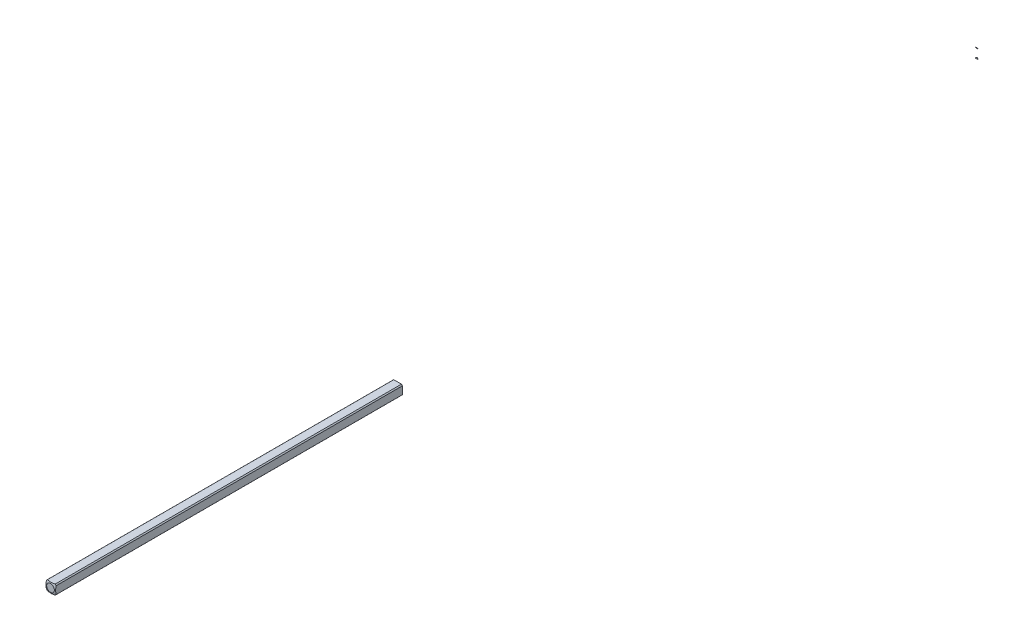
ISO-10303-21;
HEADER;
FILE_DESCRIPTION(('STEP AP214'),'2;1');
FILE_NAME('part.step','',(''),(''),'','','');
FILE_SCHEMA(('AUTOMOTIVE_DESIGN { 1 0 10303 214 1 1 1 1 }'));
ENDSEC;
DATA;
#1=APPLICATION_CONTEXT('core data for automotive mechanical design processes');
#2=APPLICATION_PROTOCOL_DEFINITION('international standard','automotive_design',2000,#1);
#3=PRODUCT_CONTEXT('',#1,'mechanical');
#4=PRODUCT('Part','Part','',(#3));
#5=PRODUCT_RELATED_PRODUCT_CATEGORY('part','',(#4));
#6=PRODUCT_DEFINITION_FORMATION('','',#4);
#7=PRODUCT_DEFINITION_CONTEXT('part definition',#1,'design');
#8=PRODUCT_DEFINITION('design','',#6,#7);
#9=PRODUCT_DEFINITION_SHAPE('','',#8);
#10=(LENGTH_UNIT() NAMED_UNIT(*) SI_UNIT(.MILLI.,.METRE.));
#11=(NAMED_UNIT(*) PLANE_ANGLE_UNIT() SI_UNIT($,.RADIAN.));
#12=(NAMED_UNIT(*) SI_UNIT($,.STERADIAN.) SOLID_ANGLE_UNIT());
#13=UNCERTAINTY_MEASURE_WITH_UNIT(LENGTH_MEASURE(1.E-05),#10,'distance_accuracy_value','');
#14=(GEOMETRIC_REPRESENTATION_CONTEXT(3) GLOBAL_UNCERTAINTY_ASSIGNED_CONTEXT((#13)) GLOBAL_UNIT_ASSIGNED_CONTEXT((#10,
#11,#12)) REPRESENTATION_CONTEXT('',''));
#15=CARTESIAN_POINT('',(0.,0.,0.));
#16=DIRECTION('',(0.,0.,1.));
#17=DIRECTION('',(1.,0.,0.));
#18=AXIS2_PLACEMENT_3D('',#15,#16,#17);
#19=CARTESIAN_POINT('',(-1.5875,-1.5875,152.4));
#20=DIRECTION('',(0.,1.,0.));
#21=DIRECTION('',(0.,0.,1.));
#22=AXIS2_PLACEMENT_3D('',#19,#20,#21);
#23=PLANE('',#22);
#24=DIRECTION('',(0.,0.,-1.));
#25=VECTOR('',#24,1.);
#26=CARTESIAN_POINT('',(-1.26841150657032,-1.5875,152.4));
#27=LINE('',#26,#25);
#28=CARTESIAN_POINT('',(-1.26841150657032,-1.5875,190.615912538673));
#29=VERTEX_POINT('',#28);
#30=CARTESIAN_POINT('',(-1.26841150657032,-1.5875,304.536774642313));
#31=VERTEX_POINT('',#30);
#32=EDGE_CURVE('E114',#29,#31,#27,.F.);
#33=ORIENTED_EDGE('',*,*,#32,.F.);
#34=DIRECTION('',(1.,0.,0.));
#35=VECTOR('',#34,1.);
#36=CARTESIAN_POINT('',(-1.5875,-1.5875,190.615912538673));
#37=LINE('',#36,#35);
#38=CARTESIAN_POINT('',(1.26841150657032,-1.5875,190.615912538673));
#39=VERTEX_POINT('',#38);
#40=EDGE_CURVE('E61',#29,#39,#37,.T.);
#41=ORIENTED_EDGE('',*,*,#40,.T.);
#42=DIRECTION('',(0.,0.,-1.));
#43=VECTOR('',#42,1.);
#44=CARTESIAN_POINT('',(1.26841150657032,-1.5875,152.4));
#45=LINE('',#44,#43);
#46=CARTESIAN_POINT('',(1.26841150657032,-1.5875,304.536774642313));
#47=VERTEX_POINT('',#46);
#48=EDGE_CURVE('E110',#47,#39,#45,.T.);
#49=ORIENTED_EDGE('',*,*,#48,.F.);
#50=CARTESIAN_POINT('',(0.,-1.5875,299.880877736238));
#51=DIRECTION('',(0.,-1.,0.));
#52=DIRECTION('',(0.,0.,-1.));
#53=AXIS2_PLACEMENT_3D('',#50,#51,#52);
#54=CIRCLE('',#53,4.82558221875869);
#55=EDGE_CURVE('E130',#47,#31,#54,.T.);
#56=ORIENTED_EDGE('',*,*,#55,.T.);
#57=EDGE_LOOP('',(#33,#41,#49,#56));
#58=FACE_BOUND('',#57,.T.);
#59=ADVANCED_FACE('F44',(#58),#23,.F.);
#60=CARTESIAN_POINT('',(-1.5875,1.5875,152.4));
#61=DIRECTION('',(0.,-1.,0.));
#62=DIRECTION('',(0.,0.,-1.));
#63=AXIS2_PLACEMENT_3D('',#60,#61,#62);
#64=PLANE('',#63);
#65=DIRECTION('',(0.,0.,-1.));
#66=VECTOR('',#65,1.);
#67=CARTESIAN_POINT('',(1.26841150657032,1.5875,152.4));
#68=LINE('',#67,#66);
#69=CARTESIAN_POINT('',(1.26841150657032,1.5875,190.615912538673));
#70=VERTEX_POINT('',#69);
#71=CARTESIAN_POINT('',(1.26841150657032,1.5875,304.536774642313));
#72=VERTEX_POINT('',#71);
#73=EDGE_CURVE('E105',#70,#72,#68,.F.);
#74=ORIENTED_EDGE('',*,*,#73,.F.);
#75=DIRECTION('',(1.,0.,0.));
#76=VECTOR('',#75,1.);
#77=CARTESIAN_POINT('',(-1.5875,1.5875,190.615912538673));
#78=LINE('',#77,#76);
#79=CARTESIAN_POINT('',(-1.26841150657032,1.5875,190.615912538673));
#80=VERTEX_POINT('',#79);
#81=EDGE_CURVE('E84',#80,#70,#78,.T.);
#82=ORIENTED_EDGE('',*,*,#81,.F.);
#83=DIRECTION('',(0.,0.,-1.));
#84=VECTOR('',#83,1.);
#85=CARTESIAN_POINT('',(-1.26841150657032,1.5875,152.4));
#86=LINE('',#85,#84);
#87=CARTESIAN_POINT('',(-1.26841150657032,1.5875,304.536774642313));
#88=VERTEX_POINT('',#87);
#89=EDGE_CURVE('E108',#88,#80,#86,.T.);
#90=ORIENTED_EDGE('',*,*,#89,.F.);
#91=CARTESIAN_POINT('',(0.,1.5875,299.880877736238));
#92=DIRECTION('',(0.,1.,0.));
#93=DIRECTION('',(0.,0.,1.));
#94=AXIS2_PLACEMENT_3D('',#91,#92,#93);
#95=CIRCLE('',#94,4.82558221875869);
#96=EDGE_CURVE('E133',#88,#72,#95,.T.);
#97=ORIENTED_EDGE('',*,*,#96,.T.);
#98=EDGE_LOOP('',(#74,#82,#90,#97));
#99=FACE_BOUND('',#98,.T.);
#100=ADVANCED_FACE('F168',(#99),#64,.F.);
#101=CARTESIAN_POINT('',(-1.5875,-1.5875,152.4));
#102=DIRECTION('',(1.,0.,0.));
#103=DIRECTION('',(0.,0.,-1.));
#104=AXIS2_PLACEMENT_3D('',#101,#102,#103);
#105=PLANE('',#104);
#106=DIRECTION('',(0.,0.,-1.));
#107=VECTOR('',#106,1.);
#108=CARTESIAN_POINT('',(-1.5875,1.26841150657032,152.4));
#109=LINE('',#108,#107);
#110=CARTESIAN_POINT('',(-1.5875,1.26841150657032,190.615912538673));
#111=VERTEX_POINT('',#110);
#112=CARTESIAN_POINT('',(-1.5875,1.26841150657032,304.536774642313));
#113=VERTEX_POINT('',#112);
#114=EDGE_CURVE('E104',#111,#113,#109,.F.);
#115=ORIENTED_EDGE('',*,*,#114,.F.);
#116=DIRECTION('',(0.,-1.,0.));
#117=VECTOR('',#116,1.);
#118=CARTESIAN_POINT('',(-1.5875,1.5875,190.615912538673));
#119=LINE('',#118,#117);
#120=CARTESIAN_POINT('',(-1.5875,-1.26841150657032,190.615912538673));
#121=VERTEX_POINT('',#120);
#122=EDGE_CURVE('E47',#111,#121,#119,.T.);
#123=ORIENTED_EDGE('',*,*,#122,.T.);
#124=DIRECTION('',(0.,0.,-1.));
#125=VECTOR('',#124,1.);
#126=CARTESIAN_POINT('',(-1.5875,-1.26841150657032,152.4));
#127=LINE('',#126,#125);
#128=CARTESIAN_POINT('',(-1.5875,-1.26841150657032,304.536774642313));
#129=VERTEX_POINT('',#128);
#130=EDGE_CURVE('E117',#129,#121,#127,.T.);
#131=ORIENTED_EDGE('',*,*,#130,.F.);
#132=CARTESIAN_POINT('',(-1.5875,0.,299.880877736238));
#133=DIRECTION('',(-1.,0.,0.));
#134=DIRECTION('',(0.,0.,1.));
#135=AXIS2_PLACEMENT_3D('',#132,#133,#134);
#136=CIRCLE('',#135,4.82558221875869);
#137=EDGE_CURVE('E136',#129,#113,#136,.T.);
#138=ORIENTED_EDGE('',*,*,#137,.T.);
#139=EDGE_LOOP('',(#115,#123,#131,#138));
#140=FACE_BOUND('',#139,.T.);
#141=ADVANCED_FACE('F193',(#140),#105,.F.);
#142=CARTESIAN_POINT('',(1.5875,-1.5875,152.4));
#143=DIRECTION('',(-1.,0.,0.));
#144=DIRECTION('',(0.,0.,1.));
#145=AXIS2_PLACEMENT_3D('',#142,#143,#144);
#146=PLANE('',#145);
#147=DIRECTION('',(0.,0.,-1.));
#148=VECTOR('',#147,1.);
#149=CARTESIAN_POINT('',(1.5875,-1.26841150657032,152.4));
#150=LINE('',#149,#148);
#151=CARTESIAN_POINT('',(1.5875,-1.26841150657032,190.615912538673));
#152=VERTEX_POINT('',#151);
#153=CARTESIAN_POINT('',(1.5875,-1.26841150657032,304.536774642313));
#154=VERTEX_POINT('',#153);
#155=EDGE_CURVE('E99',#152,#154,#150,.F.);
#156=ORIENTED_EDGE('',*,*,#155,.F.);
#157=DIRECTION('',(0.,-1.,0.));
#158=VECTOR('',#157,1.);
#159=CARTESIAN_POINT('',(1.5875,1.5875,190.615912538673));
#160=LINE('',#159,#158);
#161=CARTESIAN_POINT('',(1.5875,1.26841150657032,190.615912538673));
#162=VERTEX_POINT('',#161);
#163=EDGE_CURVE('E53',#162,#152,#160,.T.);
#164=ORIENTED_EDGE('',*,*,#163,.F.);
#165=DIRECTION('',(0.,0.,-1.));
#166=VECTOR('',#165,1.);
#167=CARTESIAN_POINT('',(1.5875,1.26841150657032,152.4));
#168=LINE('',#167,#166);
#169=CARTESIAN_POINT('',(1.5875,1.26841150657032,304.536774642313));
#170=VERTEX_POINT('',#169);
#171=EDGE_CURVE('E96',#170,#162,#168,.T.);
#172=ORIENTED_EDGE('',*,*,#171,.F.);
#173=CARTESIAN_POINT('',(1.5875,0.,299.880877736238));
#174=DIRECTION('',(1.,0.,0.));
#175=DIRECTION('',(0.,0.,-1.));
#176=AXIS2_PLACEMENT_3D('',#173,#174,#175);
#177=CIRCLE('',#176,4.82558221875869);
#178=EDGE_CURVE('E134',#170,#154,#177,.T.);
#179=ORIENTED_EDGE('',*,*,#178,.T.);
#180=EDGE_LOOP('',(#156,#164,#172,#179));
#181=FACE_BOUND('',#180,.T.);
#182=ADVANCED_FACE('F93',(#181),#146,.F.);
#183=CARTESIAN_POINT('',(0.,0.,152.4));
#184=DIRECTION('',(0.,0.,-1.));
#185=DIRECTION('',(-1.,0.,0.));
#186=AXIS2_PLACEMENT_3D('',#183,#184,#185);
#187=CYLINDRICAL_SURFACE('',#186,2.032);
#188=CARTESIAN_POINT('',(0.,0.,190.615912538673));
#189=DIRECTION('',(0.,0.,1.));
#190=DIRECTION('',(1.,0.,0.));
#191=AXIS2_PLACEMENT_3D('',#188,#189,#190);
#192=CIRCLE('',#191,2.032);
#193=EDGE_CURVE('E139',#29,#121,#192,.F.);
#194=ORIENTED_EDGE('',*,*,#193,.F.);
#195=ORIENTED_EDGE('',*,*,#32,.T.);
#196=CARTESIAN_POINT('',(0.,0.,304.536774642313));
#197=DIRECTION('',(0.,0.,1.));
#198=DIRECTION('',(1.,0.,0.));
#199=AXIS2_PLACEMENT_3D('',#196,#197,#198);
#200=CIRCLE('',#199,2.032);
#201=EDGE_CURVE('E124',#129,#31,#200,.T.);
#202=ORIENTED_EDGE('',*,*,#201,.F.);
#203=ORIENTED_EDGE('',*,*,#130,.T.);
#204=EDGE_LOOP('',(#194,#195,#202,#203));
#205=FACE_BOUND('',#204,.T.);
#206=ADVANCED_FACE('F191',(#205),#187,.T.);
#207=CARTESIAN_POINT('',(0.,0.,190.615912538673));
#208=DIRECTION('',(0.,0.,1.));
#209=DIRECTION('',(1.,0.,0.));
#210=AXIS2_PLACEMENT_3D('',#207,#208,#209);
#211=CIRCLE('',#210,2.032);
#212=EDGE_CURVE('E13',#152,#39,#211,.F.);
#213=ORIENTED_EDGE('',*,*,#212,.F.);
#214=ORIENTED_EDGE('',*,*,#155,.T.);
#215=CARTESIAN_POINT('',(0.,0.,304.536774642313));
#216=DIRECTION('',(0.,0.,1.));
#217=DIRECTION('',(1.,0.,0.));
#218=AXIS2_PLACEMENT_3D('',#215,#216,#217);
#219=CIRCLE('',#218,2.032);
#220=EDGE_CURVE('E127',#47,#154,#219,.T.);
#221=ORIENTED_EDGE('',*,*,#220,.F.);
#222=ORIENTED_EDGE('',*,*,#48,.T.);
#223=EDGE_LOOP('',(#213,#214,#221,#222));
#224=FACE_BOUND('',#223,.T.);
#225=ADVANCED_FACE('F156',(#224),#187,.T.);
#226=CARTESIAN_POINT('',(0.,0.,190.615912538673));
#227=DIRECTION('',(0.,0.,1.));
#228=DIRECTION('',(1.,0.,0.));
#229=AXIS2_PLACEMENT_3D('',#226,#227,#228);
#230=CIRCLE('',#229,2.032);
#231=EDGE_CURVE('E81',#70,#162,#230,.F.);
#232=ORIENTED_EDGE('',*,*,#231,.F.);
#233=ORIENTED_EDGE('',*,*,#73,.T.);
#234=CARTESIAN_POINT('',(0.,0.,304.536774642313));
#235=DIRECTION('',(0.,0.,1.));
#236=DIRECTION('',(1.,0.,0.));
#237=AXIS2_PLACEMENT_3D('',#234,#235,#236);
#238=CIRCLE('',#237,2.032);
#239=EDGE_CURVE('E102',#170,#72,#238,.T.);
#240=ORIENTED_EDGE('',*,*,#239,.F.);
#241=ORIENTED_EDGE('',*,*,#171,.T.);
#242=EDGE_LOOP('',(#232,#233,#240,#241));
#243=FACE_BOUND('',#242,.T.);
#244=ADVANCED_FACE('F100',(#243),#187,.T.);
#245=CARTESIAN_POINT('',(0.,0.,190.615912538673));
#246=DIRECTION('',(0.,0.,1.));
#247=DIRECTION('',(1.,0.,0.));
#248=AXIS2_PLACEMENT_3D('',#245,#246,#247);
#249=CIRCLE('',#248,2.032);
#250=EDGE_CURVE('E145',#111,#80,#249,.F.);
#251=ORIENTED_EDGE('',*,*,#250,.F.);
#252=ORIENTED_EDGE('',*,*,#114,.T.);
#253=CARTESIAN_POINT('',(0.,0.,304.536774642313));
#254=DIRECTION('',(0.,0.,1.));
#255=DIRECTION('',(1.,0.,0.));
#256=AXIS2_PLACEMENT_3D('',#253,#254,#255);
#257=CIRCLE('',#256,2.032);
#258=EDGE_CURVE('E121',#88,#113,#257,.T.);
#259=ORIENTED_EDGE('',*,*,#258,.F.);
#260=ORIENTED_EDGE('',*,*,#89,.T.);
#261=EDGE_LOOP('',(#251,#252,#259,#260));
#262=FACE_BOUND('',#261,.T.);
#263=ADVANCED_FACE('F171',(#262),#187,.T.);
#264=CARTESIAN_POINT('',(0.,0.,299.880877736238));
#265=DIRECTION('',(0.,0.,-1.));
#266=DIRECTION('',(-1.,0.,0.));
#267=AXIS2_PLACEMENT_3D('',#264,#265,#266);
#268=SPHERICAL_SURFACE('',#267,5.08);
#269=CARTESIAN_POINT('',(0.,0.,304.8));
#270=DIRECTION('',(0.,0.,-1.));
#271=DIRECTION('',(-1.,0.,0.));
#272=AXIS2_PLACEMENT_3D('',#269,#270,#271);
#273=CIRCLE('',#272,1.26832020963187);
#274=CARTESIAN_POINT('',(-1.26832020963187,0.,304.8));
#275=VERTEX_POINT('',#274);
#276=EDGE_CURVE('E119',#275,#275,#273,.T.);
#277=ORIENTED_EDGE('',*,*,#276,.T.);
#278=EDGE_LOOP('',(#277));
#279=FACE_BOUND('',#278,.T.);
#280=ORIENTED_EDGE('',*,*,#55,.F.);
#281=ORIENTED_EDGE('',*,*,#220,.T.);
#282=ORIENTED_EDGE('',*,*,#178,.F.);
#283=ORIENTED_EDGE('',*,*,#239,.T.);
#284=ORIENTED_EDGE('',*,*,#96,.F.);
#285=ORIENTED_EDGE('',*,*,#258,.T.);
#286=ORIENTED_EDGE('',*,*,#137,.F.);
#287=ORIENTED_EDGE('',*,*,#201,.T.);
#288=EDGE_LOOP('',(#280,#281,#282,#283,#284,#285,#286,#287));
#289=FACE_BOUND('',#288,.T.);
#290=ADVANCED_FACE('F176',(#279,#289),#268,.T.);
#291=CARTESIAN_POINT('',(0.,0.,304.8));
#292=DIRECTION('',(0.,0.,1.));
#293=DIRECTION('',(-1.,0.,0.));
#294=AXIS2_PLACEMENT_3D('',#291,#292,#293);
#295=PLANE('',#294);
#296=ORIENTED_EDGE('',*,*,#276,.F.);
#297=EDGE_LOOP('',(#296));
#298=FACE_BOUND('',#297,.T.);
#299=ADVANCED_FACE('F270',(#298),#295,.T.);
#300=CARTESIAN_POINT('',(-1.5875,1.5875,190.615912538673));
#301=DIRECTION('',(0.,0.,1.));
#302=DIRECTION('',(1.,0.,0.));
#303=AXIS2_PLACEMENT_3D('',#300,#301,#302);
#304=PLANE('',#303);
#305=ORIENTED_EDGE('',*,*,#193,.T.);
#306=ORIENTED_EDGE('',*,*,#122,.F.);
#307=ORIENTED_EDGE('',*,*,#250,.T.);
#308=ORIENTED_EDGE('',*,*,#81,.T.);
#309=ORIENTED_EDGE('',*,*,#231,.T.);
#310=ORIENTED_EDGE('',*,*,#163,.T.);
#311=ORIENTED_EDGE('',*,*,#212,.T.);
#312=ORIENTED_EDGE('',*,*,#40,.F.);
#313=EDGE_LOOP('',(#305,#306,#307,#308,#309,#310,#311,#312));
#314=FACE_BOUND('',#313,.T.);
#315=ADVANCED_FACE('F82',(#314),#304,.F.);
#316=CLOSED_SHELL('',(#59,#100,#141,#182,#206,#225,#244,#263,#290,#299,#315));
#317=MANIFOLD_SOLID_BREP('B2',#316);
#318=CARTESIAN_POINT('',(0.,0.,4.91912226376204));
#319=DIRECTION('',(0.,0.,1.));
#320=DIRECTION('',(-1.,0.,0.));
#321=AXIS2_PLACEMENT_3D('',#318,#319,#320);
#322=SPHERICAL_SURFACE('',#321,5.08);
#323=CARTESIAN_POINT('',(0.,-1.7260493401115,0.166227772370093));
#324=DIRECTION('',(0.,-0.341345507381833,-0.93993789400696));
#325=DIRECTION('',(0.,0.93993789400696,-0.341345507381833));
#326=AXIS2_PLACEMENT_3D('',#323,#324,#325);
#327=CIRCLE('',#326,0.486978058229274);
#328=CARTESIAN_POINT('',(0.464133694973146,-1.5875,0.115912538672931));
#329=VERTEX_POINT('',#328);
#330=CARTESIAN_POINT('',(-0.464133694973143,-1.5875,0.115912538672932));
#331=VERTEX_POINT('',#330);
#332=EDGE_CURVE('E324',#329,#331,#327,.F.);
#333=ORIENTED_EDGE('',*,*,#332,.F.);
#334=CARTESIAN_POINT('',(0.,-1.5875,4.91912226376204));
#335=DIRECTION('',(0.,1.,0.));
#336=DIRECTION('',(0.,0.,1.));
#337=AXIS2_PLACEMENT_3D('',#334,#335,#336);
#338=CIRCLE('',#337,4.82558221875869);
#339=EDGE_CURVE('E333',#329,#331,#338,.T.);
#340=ORIENTED_EDGE('',*,*,#339,.T.);
#341=EDGE_LOOP('',(#333,#340));
#342=FACE_BOUND('',#341,.T.);
#343=ADVANCED_FACE('F316',(#342),#322,.T.);
#344=CARTESIAN_POINT('',(-1.5875,-1.5875,152.4));
#345=DIRECTION('',(0.,1.,0.));
#346=DIRECTION('',(0.,0.,1.));
#347=AXIS2_PLACEMENT_3D('',#344,#345,#346);
#348=PLANE('',#347);
#349=ORIENTED_EDGE('',*,*,#339,.F.);
#350=DIRECTION('',(1.,0.,0.));
#351=VECTOR('',#350,1.);
#352=CARTESIAN_POINT('',(-1.5875,-1.5875,0.115912538672932));
#353=LINE('',#352,#351);
#354=EDGE_CURVE('E42',#331,#329,#353,.T.);
#355=ORIENTED_EDGE('',*,*,#354,.F.);
#356=EDGE_LOOP('',(#349,#355));
#357=FACE_BOUND('',#356,.T.);
#358=ADVANCED_FACE('F335',(#357),#348,.F.);
#359=CARTESIAN_POINT('',(-1.5875,-1.5875,0.115912538672932));
#360=DIRECTION('',(0.,-0.341345507381833,-0.93993789400696));
#361=DIRECTION('',(0.,0.93993789400696,-0.341345507381833));
#362=AXIS2_PLACEMENT_3D('',#359,#360,#361);
#363=PLANE('',#362);
#364=ORIENTED_EDGE('',*,*,#332,.T.);
#365=ORIENTED_EDGE('',*,*,#354,.T.);
#366=EDGE_LOOP('',(#364,#365));
#367=FACE_BOUND('',#366,.T.);
#368=ADVANCED_FACE('F331',(#367),#363,.F.);
#369=CLOSED_SHELL('',(#343,#358,#368));
#370=MANIFOLD_SOLID_BREP('B7',#369);
#371=CARTESIAN_POINT('',(0.,0.,4.91912226376204));
#372=DIRECTION('',(0.,0.,1.));
#373=DIRECTION('',(-1.,0.,0.));
#374=AXIS2_PLACEMENT_3D('',#371,#372,#373);
#375=SPHERICAL_SURFACE('',#374,5.08);
#376=CARTESIAN_POINT('',(0.,1.72604934011151,0.166227772370097));
#377=DIRECTION('',(0.,0.341345507381835,-0.939937894006959));
#378=DIRECTION('',(0.,0.939937894006959,0.341345507381835));
#379=AXIS2_PLACEMENT_3D('',#376,#377,#378);
#380=CIRCLE('',#379,0.486978058229285);
#381=CARTESIAN_POINT('',(-0.46413369497315,1.5875,0.115912538672932));
#382=VERTEX_POINT('',#381);
#383=CARTESIAN_POINT('',(0.46413369497315,1.5875,0.115912538672932));
#384=VERTEX_POINT('',#383);
#385=EDGE_CURVE('E373',#382,#384,#380,.F.);
#386=ORIENTED_EDGE('',*,*,#385,.F.);
#387=CARTESIAN_POINT('',(0.,1.5875,4.91912226376204));
#388=DIRECTION('',(0.,-1.,0.));
#389=DIRECTION('',(0.,0.,-1.));
#390=AXIS2_PLACEMENT_3D('',#387,#388,#389);
#391=CIRCLE('',#390,4.82558221875869);
#392=EDGE_CURVE('E314',#382,#384,#391,.T.);
#393=ORIENTED_EDGE('',*,*,#392,.T.);
#394=EDGE_LOOP('',(#386,#393));
#395=FACE_BOUND('',#394,.T.);
#396=ADVANCED_FACE('F365',(#395),#375,.T.);
#397=CARTESIAN_POINT('',(-1.5875,1.5875,152.4));
#398=DIRECTION('',(0.,-1.,0.));
#399=DIRECTION('',(0.,0.,-1.));
#400=AXIS2_PLACEMENT_3D('',#397,#398,#399);
#401=PLANE('',#400);
#402=ORIENTED_EDGE('',*,*,#392,.F.);
#403=DIRECTION('',(1.,0.,0.));
#404=VECTOR('',#403,1.);
#405=CARTESIAN_POINT('',(-1.5875,1.5875,0.115912538672932));
#406=LINE('',#405,#404);
#407=EDGE_CURVE('E380',#382,#384,#406,.T.);
#408=ORIENTED_EDGE('',*,*,#407,.T.);
#409=EDGE_LOOP('',(#402,#408));
#410=FACE_BOUND('',#409,.T.);
#411=ADVANCED_FACE('F367',(#410),#401,.F.);
#412=CARTESIAN_POINT('',(-1.5875,1.26832020963187,0.));
#413=DIRECTION('',(0.,0.341345507381835,-0.939937894006959));
#414=DIRECTION('',(0.,0.939937894006959,0.341345507381835));
#415=AXIS2_PLACEMENT_3D('',#412,#413,#414);
#416=PLANE('',#415);
#417=ORIENTED_EDGE('',*,*,#385,.T.);
#418=ORIENTED_EDGE('',*,*,#407,.F.);
#419=EDGE_LOOP('',(#417,#418));
#420=FACE_BOUND('',#419,.T.);
#421=ADVANCED_FACE('F381',(#420),#416,.F.);
#422=CLOSED_SHELL('',(#396,#411,#421));
#423=MANIFOLD_SOLID_BREP('B36',#422);
#424=ADVANCED_BREP_SHAPE_REPRESENTATION('',(#18,#317,#370,#423),#14);
#425=SHAPE_DEFINITION_REPRESENTATION(#9,#424);
ENDSEC;
END-ISO-10303-21;
